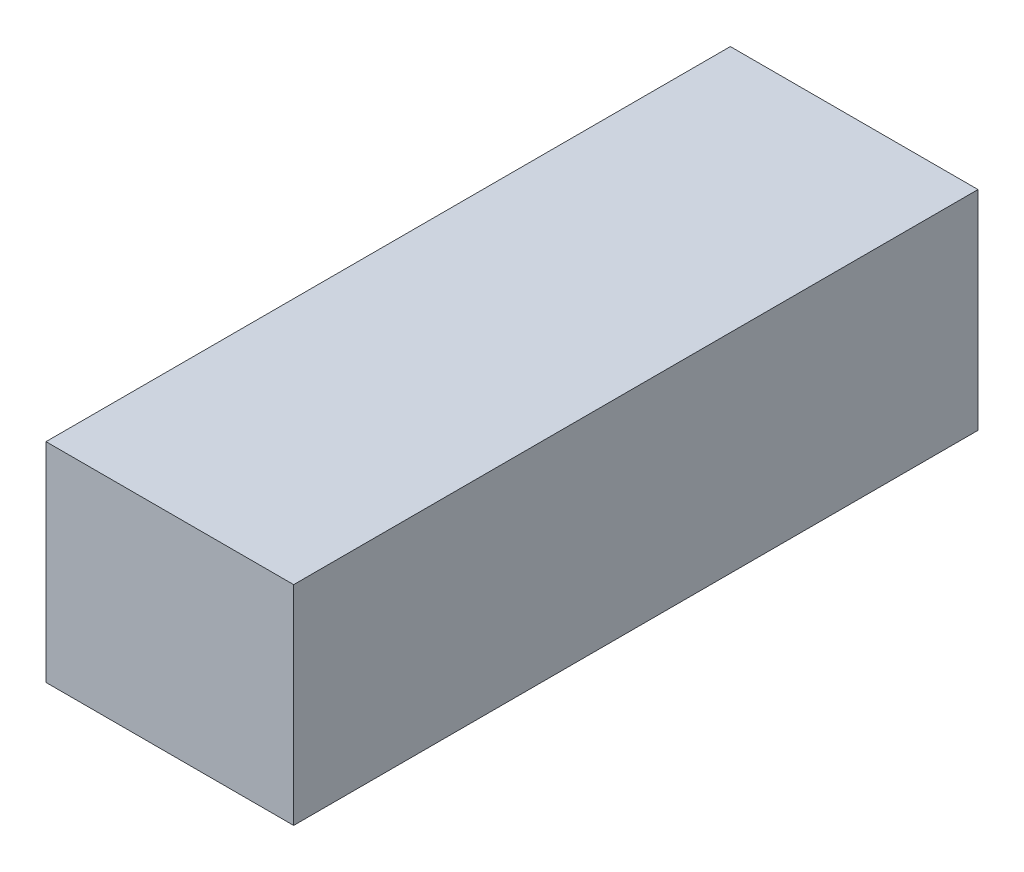
ISO-10303-21;
HEADER;
FILE_DESCRIPTION(('STEP AP214'),'2;1');
FILE_NAME('part.step','',(''),(''),'','','');
FILE_SCHEMA(('AUTOMOTIVE_DESIGN { 1 0 10303 214 1 1 1 1 }'));
ENDSEC;
DATA;
#1=APPLICATION_CONTEXT('core data for automotive mechanical design processes');
#2=APPLICATION_PROTOCOL_DEFINITION('international standard','automotive_design',2000,#1);
#3=PRODUCT_CONTEXT('',#1,'mechanical');
#4=PRODUCT('Part','Part','',(#3));
#5=PRODUCT_RELATED_PRODUCT_CATEGORY('part','',(#4));
#6=PRODUCT_DEFINITION_FORMATION('','',#4);
#7=PRODUCT_DEFINITION_CONTEXT('part definition',#1,'design');
#8=PRODUCT_DEFINITION('design','',#6,#7);
#9=PRODUCT_DEFINITION_SHAPE('','',#8);
#10=(LENGTH_UNIT() NAMED_UNIT(*) SI_UNIT(.MILLI.,.METRE.));
#11=(NAMED_UNIT(*) PLANE_ANGLE_UNIT() SI_UNIT($,.RADIAN.));
#12=(NAMED_UNIT(*) SI_UNIT($,.STERADIAN.) SOLID_ANGLE_UNIT());
#13=UNCERTAINTY_MEASURE_WITH_UNIT(LENGTH_MEASURE(1.E-05),#10,'distance_accuracy_value','');
#14=(GEOMETRIC_REPRESENTATION_CONTEXT(3) GLOBAL_UNCERTAINTY_ASSIGNED_CONTEXT((#13)) GLOBAL_UNIT_ASSIGNED_CONTEXT((#10,
#11,#12)) REPRESENTATION_CONTEXT('',''));
#15=CARTESIAN_POINT('',(0.,0.,0.));
#16=DIRECTION('',(0.,0.,1.));
#17=DIRECTION('',(1.,0.,0.));
#18=AXIS2_PLACEMENT_3D('',#15,#16,#17);
#19=CARTESIAN_POINT('',(-34.5955745095698,-7.56983565850078,105.));
#20=DIRECTION('',(1.,0.,0.));
#21=DIRECTION('',(0.,0.,-1.));
#22=AXIS2_PLACEMENT_3D('',#19,#20,#21);
#23=PLANE('',#22);
#24=DIRECTION('',(0.,-1.,0.));
#25=VECTOR('',#24,1.);
#26=CARTESIAN_POINT('',(-34.5955745095698,-7.56983565850078,0.));
#27=LINE('',#26,#25);
#28=CARTESIAN_POINT('',(-34.5955745095698,24.4301643414992,0.));
#29=VERTEX_POINT('',#28);
#30=CARTESIAN_POINT('',(-34.5955745095698,-7.56983565850078,0.));
#31=VERTEX_POINT('',#30);
#32=EDGE_CURVE('E96',#29,#31,#27,.T.);
#33=ORIENTED_EDGE('',*,*,#32,.T.);
#34=DIRECTION('',(0.,0.,-1.));
#35=VECTOR('',#34,1.);
#36=CARTESIAN_POINT('',(-34.5955745095698,-7.56983565850078,105.));
#37=LINE('',#36,#35);
#38=CARTESIAN_POINT('',(-34.5955745095698,-7.56983565850078,105.));
#39=VERTEX_POINT('',#38);
#40=EDGE_CURVE('E11',#39,#31,#37,.T.);
#41=ORIENTED_EDGE('',*,*,#40,.F.);
#42=DIRECTION('',(0.,-1.,0.));
#43=VECTOR('',#42,1.);
#44=CARTESIAN_POINT('',(-34.5955745095698,-7.56983565850078,105.));
#45=LINE('',#44,#43);
#46=CARTESIAN_POINT('',(-34.5955745095698,24.4301643414992,105.));
#47=VERTEX_POINT('',#46);
#48=EDGE_CURVE('E84',#47,#39,#45,.T.);
#49=ORIENTED_EDGE('',*,*,#48,.F.);
#50=DIRECTION('',(0.,0.,-1.));
#51=VECTOR('',#50,1.);
#52=CARTESIAN_POINT('',(-34.5955745095698,24.4301643414992,105.));
#53=LINE('',#52,#51);
#54=EDGE_CURVE('E92',#47,#29,#53,.T.);
#55=ORIENTED_EDGE('',*,*,#54,.T.);
#56=EDGE_LOOP('',(#33,#41,#49,#55));
#57=FACE_BOUND('',#56,.T.);
#58=ADVANCED_FACE('F33',(#57),#23,.F.);
#59=CARTESIAN_POINT('',(-34.5955745095698,-7.56983565850078,105.));
#60=DIRECTION('',(0.,1.,0.));
#61=DIRECTION('',(0.,0.,1.));
#62=AXIS2_PLACEMENT_3D('',#59,#60,#61);
#63=PLANE('',#62);
#64=DIRECTION('',(1.,0.,0.));
#65=VECTOR('',#64,1.);
#66=CARTESIAN_POINT('',(-34.5955745095698,-7.56983565850078,0.));
#67=LINE('',#66,#65);
#68=CARTESIAN_POINT('',(3.40442549043019,-7.56983565850078,0.));
#69=VERTEX_POINT('',#68);
#70=EDGE_CURVE('E88',#31,#69,#67,.T.);
#71=ORIENTED_EDGE('',*,*,#70,.T.);
#72=DIRECTION('',(0.,0.,-1.));
#73=VECTOR('',#72,1.);
#74=CARTESIAN_POINT('',(3.40442549043019,-7.56983565850078,105.));
#75=LINE('',#74,#73);
#76=CARTESIAN_POINT('',(3.40442549043019,-7.56983565850078,105.));
#77=VERTEX_POINT('',#76);
#78=EDGE_CURVE('E41',#77,#69,#75,.T.);
#79=ORIENTED_EDGE('',*,*,#78,.F.);
#80=DIRECTION('',(1.,0.,0.));
#81=VECTOR('',#80,1.);
#82=CARTESIAN_POINT('',(-34.5955745095698,-7.56983565850078,105.));
#83=LINE('',#82,#81);
#84=EDGE_CURVE('E79',#39,#77,#83,.T.);
#85=ORIENTED_EDGE('',*,*,#84,.F.);
#86=ORIENTED_EDGE('',*,*,#40,.T.);
#87=EDGE_LOOP('',(#71,#79,#85,#86));
#88=FACE_BOUND('',#87,.T.);
#89=ADVANCED_FACE('F87',(#88),#63,.F.);
#90=CARTESIAN_POINT('',(3.40442549043019,-7.56983565850078,105.));
#91=DIRECTION('',(-1.,0.,0.));
#92=DIRECTION('',(0.,0.,1.));
#93=AXIS2_PLACEMENT_3D('',#90,#91,#92);
#94=PLANE('',#93);
#95=DIRECTION('',(0.,1.,0.));
#96=VECTOR('',#95,1.);
#97=CARTESIAN_POINT('',(3.40442549043019,-7.56983565850078,0.));
#98=LINE('',#97,#96);
#99=CARTESIAN_POINT('',(3.40442549043019,24.4301643414992,0.));
#100=VERTEX_POINT('',#99);
#101=EDGE_CURVE('E66',#69,#100,#98,.T.);
#102=ORIENTED_EDGE('',*,*,#101,.T.);
#103=DIRECTION('',(0.,0.,-1.));
#104=VECTOR('',#103,1.);
#105=CARTESIAN_POINT('',(3.40442549043019,24.4301643414992,105.));
#106=LINE('',#105,#104);
#107=CARTESIAN_POINT('',(3.40442549043019,24.4301643414992,105.));
#108=VERTEX_POINT('',#107);
#109=EDGE_CURVE('E89',#108,#100,#106,.T.);
#110=ORIENTED_EDGE('',*,*,#109,.F.);
#111=DIRECTION('',(0.,1.,0.));
#112=VECTOR('',#111,1.);
#113=CARTESIAN_POINT('',(3.40442549043019,-7.56983565850078,105.));
#114=LINE('',#113,#112);
#115=EDGE_CURVE('E82',#77,#108,#114,.T.);
#116=ORIENTED_EDGE('',*,*,#115,.F.);
#117=ORIENTED_EDGE('',*,*,#78,.T.);
#118=EDGE_LOOP('',(#102,#110,#116,#117));
#119=FACE_BOUND('',#118,.T.);
#120=ADVANCED_FACE('F90',(#119),#94,.F.);
#121=CARTESIAN_POINT('',(-34.5955745095698,24.4301643414992,105.));
#122=DIRECTION('',(0.,-1.,0.));
#123=DIRECTION('',(0.,0.,-1.));
#124=AXIS2_PLACEMENT_3D('',#121,#122,#123);
#125=PLANE('',#124);
#126=DIRECTION('',(-1.,0.,0.));
#127=VECTOR('',#126,1.);
#128=CARTESIAN_POINT('',(-34.5955745095698,24.4301643414992,0.));
#129=LINE('',#128,#127);
#130=EDGE_CURVE('E72',#100,#29,#129,.T.);
#131=ORIENTED_EDGE('',*,*,#130,.T.);
#132=ORIENTED_EDGE('',*,*,#54,.F.);
#133=DIRECTION('',(-1.,0.,0.));
#134=VECTOR('',#133,1.);
#135=CARTESIAN_POINT('',(-34.5955745095698,24.4301643414992,105.));
#136=LINE('',#135,#134);
#137=EDGE_CURVE('E49',#108,#47,#136,.T.);
#138=ORIENTED_EDGE('',*,*,#137,.F.);
#139=ORIENTED_EDGE('',*,*,#109,.T.);
#140=EDGE_LOOP('',(#131,#132,#138,#139));
#141=FACE_BOUND('',#140,.T.);
#142=ADVANCED_FACE('F103',(#141),#125,.F.);
#143=CARTESIAN_POINT('',(0.,0.,105.));
#144=DIRECTION('',(0.,0.,-1.));
#145=DIRECTION('',(-1.,0.,0.));
#146=AXIS2_PLACEMENT_3D('',#143,#144,#145);
#147=PLANE('',#146);
#148=ORIENTED_EDGE('',*,*,#48,.T.);
#149=ORIENTED_EDGE('',*,*,#84,.T.);
#150=ORIENTED_EDGE('',*,*,#115,.T.);
#151=ORIENTED_EDGE('',*,*,#137,.T.);
#152=EDGE_LOOP('',(#148,#149,#150,#151));
#153=FACE_BOUND('',#152,.T.);
#154=ADVANCED_FACE('F80',(#153),#147,.F.);
#155=CARTESIAN_POINT('',(0.,0.,0.));
#156=DIRECTION('',(0.,0.,-1.));
#157=DIRECTION('',(-1.,0.,0.));
#158=AXIS2_PLACEMENT_3D('',#155,#156,#157);
#159=PLANE('',#158);
#160=ORIENTED_EDGE('',*,*,#32,.F.);
#161=ORIENTED_EDGE('',*,*,#130,.F.);
#162=ORIENTED_EDGE('',*,*,#101,.F.);
#163=ORIENTED_EDGE('',*,*,#70,.F.);
#164=EDGE_LOOP('',(#160,#161,#162,#163));
#165=FACE_BOUND('',#164,.T.);
#166=ADVANCED_FACE('F106',(#165),#159,.T.);
#167=CLOSED_SHELL('',(#58,#89,#120,#142,#154,#166));
#168=MANIFOLD_SOLID_BREP('B2',#167);
#169=ADVANCED_BREP_SHAPE_REPRESENTATION('',(#18,#168),#14);
#170=SHAPE_DEFINITION_REPRESENTATION(#9,#169);
ENDSEC;
END-ISO-10303-21;
